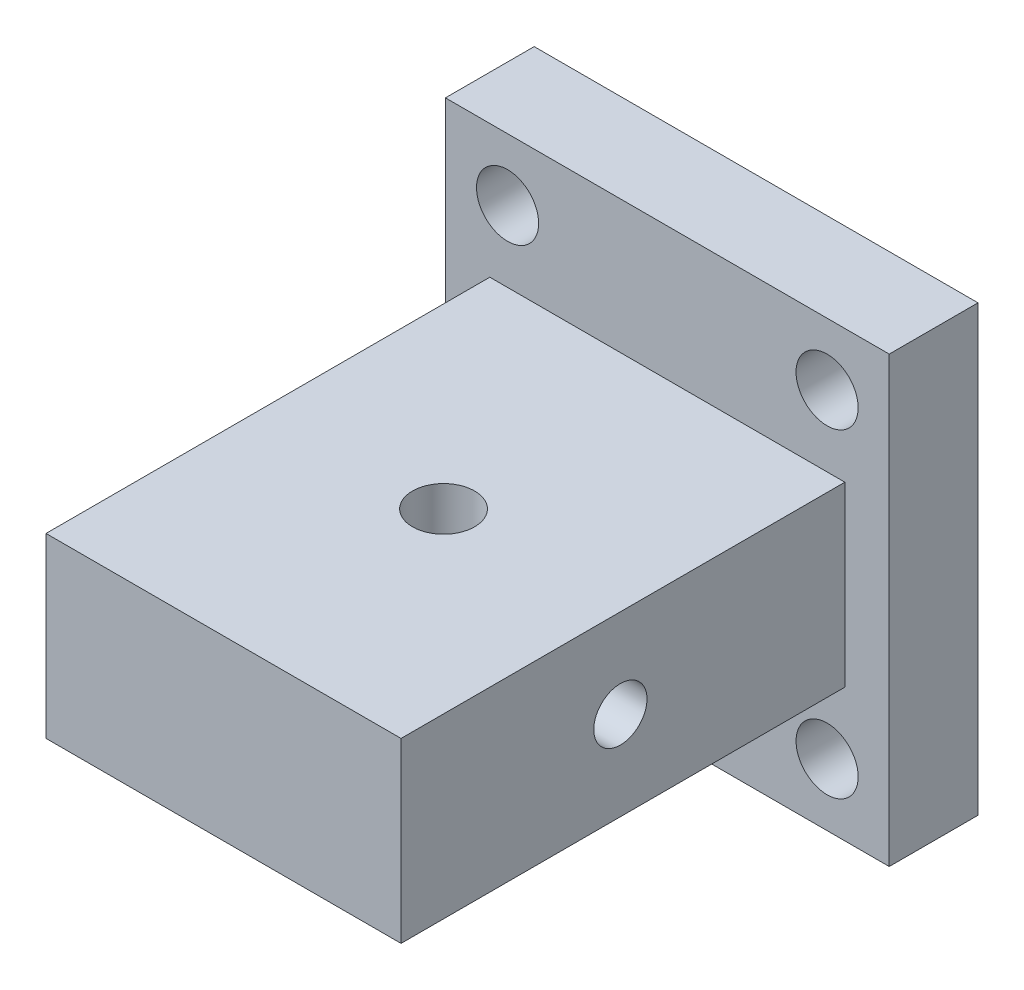
ISO-10303-21;
HEADER;
FILE_DESCRIPTION(('STEP AP214'),'2;1');
FILE_NAME('part.step','',(''),(''),'','','');
FILE_SCHEMA(('AUTOMOTIVE_DESIGN { 1 0 10303 214 1 1 1 1 }'));
ENDSEC;
DATA;
#1=APPLICATION_CONTEXT('core data for automotive mechanical design processes');
#2=APPLICATION_PROTOCOL_DEFINITION('international standard','automotive_design',2000,#1);
#3=PRODUCT_CONTEXT('',#1,'mechanical');
#4=PRODUCT('Part','Part','',(#3));
#5=PRODUCT_RELATED_PRODUCT_CATEGORY('part','',(#4));
#6=PRODUCT_DEFINITION_FORMATION('','',#4);
#7=PRODUCT_DEFINITION_CONTEXT('part definition',#1,'design');
#8=PRODUCT_DEFINITION('design','',#6,#7);
#9=PRODUCT_DEFINITION_SHAPE('','',#8);
#10=(LENGTH_UNIT() NAMED_UNIT(*) SI_UNIT(.MILLI.,.METRE.));
#11=(NAMED_UNIT(*) PLANE_ANGLE_UNIT() SI_UNIT($,.RADIAN.));
#12=(NAMED_UNIT(*) SI_UNIT($,.STERADIAN.) SOLID_ANGLE_UNIT());
#13=UNCERTAINTY_MEASURE_WITH_UNIT(LENGTH_MEASURE(1.E-05),#10,'distance_accuracy_value','');
#14=(GEOMETRIC_REPRESENTATION_CONTEXT(3) GLOBAL_UNCERTAINTY_ASSIGNED_CONTEXT((#13)) GLOBAL_UNIT_ASSIGNED_CONTEXT((#10,
#11,#12)) REPRESENTATION_CONTEXT('',''));
#15=CARTESIAN_POINT('',(0.,0.,0.));
#16=DIRECTION('',(0.,0.,1.));
#17=DIRECTION('',(1.,0.,0.));
#18=AXIS2_PLACEMENT_3D('',#15,#16,#17);
#19=CARTESIAN_POINT('',(-25.,0.,35.2899848463976));
#20=DIRECTION('',(1.,0.,0.));
#21=DIRECTION('',(0.,0.,-1.));
#22=AXIS2_PLACEMENT_3D('',#19,#20,#21);
#23=CYLINDRICAL_SURFACE('',#22,3.);
#24=CARTESIAN_POINT('',(20.,0.,35.2899848463976));
#25=DIRECTION('',(1.,0.,0.));
#26=DIRECTION('',(0.,0.,-1.));
#27=AXIS2_PLACEMENT_3D('',#24,#25,#26);
#28=CIRCLE('',#27,3.);
#29=CARTESIAN_POINT('',(20.,0.,32.2899848463976));
#30=VERTEX_POINT('',#29);
#31=EDGE_CURVE('E171',#30,#30,#28,.T.);
#32=ORIENTED_EDGE('',*,*,#31,.T.);
#33=EDGE_LOOP('',(#32));
#34=FACE_BOUND('',#33,.T.);
#35=CARTESIAN_POINT('',(-20.,0.,35.2899848463976));
#36=DIRECTION('',(-1.,0.,0.));
#37=DIRECTION('',(0.,0.,1.));
#38=AXIS2_PLACEMENT_3D('',#35,#36,#37);
#39=CIRCLE('',#38,3.);
#40=CARTESIAN_POINT('',(-20.,0.,38.2899848463976));
#41=VERTEX_POINT('',#40);
#42=EDGE_CURVE('E174',#41,#41,#39,.T.);
#43=ORIENTED_EDGE('',*,*,#42,.T.);
#44=EDGE_LOOP('',(#43));
#45=FACE_BOUND('',#44,.T.);
#46=DIRECTION('',(1.,0.,0.));
#47=VECTOR('',#46,1.);
#48=CARTESIAN_POINT('',(-25.,0.,38.2899848463976));
#49=LINE('',#48,#47);
#50=CARTESIAN_POINT('',(1.66542404359977,0.,38.2899848463976));
#51=VERTEX_POINT('',#50);
#52=CARTESIAN_POINT('',(-1.66542404359977,0.,38.2899848463976));
#53=VERTEX_POINT('',#52);
#54=EDGE_CURVE('E11',#51,#53,#49,.F.);
#55=ORIENTED_EDGE('',*,*,#54,.F.);
#56=CARTESIAN_POINT('',(1.66542404359977,0.,38.2899848463976));
#57=CARTESIAN_POINT('',(1.66538230950996,0.0481518719208806,38.2899966460254));
#58=CARTESIAN_POINT('',(1.667565897211,0.0962759116581786,38.2888261094072));
#59=CARTESIAN_POINT('',(1.67605317767951,0.191940055302888,38.284217223856));
#60=CARTESIAN_POINT('',(1.68234717425708,0.239481265857675,38.2807842117833));
#61=CARTESIAN_POINT('',(1.69858929746254,0.332886563251243,38.2718227108308));
#62=CARTESIAN_POINT('',(1.70847393905396,0.378765413997259,38.2663305774704));
#63=CARTESIAN_POINT('',(1.73142658030867,0.469454230189679,38.2533801397009));
#64=CARTESIAN_POINT('',(1.74449668033902,0.514263468884244,38.2459205377517));
#65=CARTESIAN_POINT('',(1.77986062033508,0.622767440648714,38.2253631286242));
#66=CARTESIAN_POINT('',(1.80364597246327,0.685782936125968,38.2112440262263));
#67=CARTESIAN_POINT('',(1.85540370100787,0.809135195903117,38.1795104484976));
#68=CARTESIAN_POINT('',(1.88337810590602,0.869470643978167,38.1618942784143));
#69=CARTESIAN_POINT('',(1.97226935102203,1.04776025079831,38.1038699192224));
#70=CARTESIAN_POINT('',(2.03773475738796,1.16185327276221,38.0585134924075));
#71=CARTESIAN_POINT('',(2.16101485338395,1.36025296108844,37.9656744045183));
#72=CARTESIAN_POINT('',(2.21793776647455,1.44611429965335,37.920212958185));
#73=CARTESIAN_POINT('',(2.33313492425084,1.61247684254439,37.8216381962503));
#74=CARTESIAN_POINT('',(2.39140991209111,1.69297500021367,37.7685205847081));
#75=CARTESIAN_POINT('',(2.50744404202027,1.84844337372949,37.6548318098248));
#76=CARTESIAN_POINT('',(2.56520418026771,1.92342867207951,37.5942822925791));
#77=CARTESIAN_POINT('',(2.67903086338832,2.06792644757097,37.4655405574596));
#78=CARTESIAN_POINT('',(2.73509726501376,2.13743846260385,37.3973476954347));
#79=CARTESIAN_POINT('',(2.87474476445089,2.30765019856549,37.2130289513801));
#80=CARTESIAN_POINT('',(2.95626570374454,2.40416695456465,37.0913541655803));
#81=CARTESIAN_POINT('',(3.10733290733121,2.57971415498602,36.8294132316946));
#82=CARTESIAN_POINT('',(3.17689634898637,2.65876973035129,36.6891742734737));
#83=CARTESIAN_POINT('',(3.28726711617649,2.78208898436559,36.4202314835731));
#84=CARTESIAN_POINT('',(3.33103131189795,2.83011858180776,36.2944843894987));
#85=CARTESIAN_POINT('',(3.40471361916409,2.90947475013154,36.0339327390208));
#86=CARTESIAN_POINT('',(3.43464060681718,2.94081203054621,35.8991340526526));
#87=CARTESIAN_POINT('',(3.47854461303296,2.98473329880833,35.6231269645348));
#88=CARTESIAN_POINT('',(3.49243269252006,2.99721283314379,35.4818872935568));
#89=CARTESIAN_POINT('',(3.50284457304123,3.00194791351435,35.198433504012));
#90=CARTESIAN_POINT('',(3.4993724000847,2.99420814879805,35.0562196190138));
#91=CARTESIAN_POINT('',(3.47668139204112,2.96056881801837,34.7883695248012));
#92=CARTESIAN_POINT('',(3.45890056611499,2.93635759041427,34.6623892546482));
#93=CARTESIAN_POINT('',(3.41085700162234,2.87291710966392,34.4168048177358));
#94=CARTESIAN_POINT('',(3.38059233328534,2.83368553471794,34.297201639986));
#95=CARTESIAN_POINT('',(3.30740406481644,2.73918614769174,34.0594460446968));
#96=CARTESIAN_POINT('',(3.26381621987621,2.68308025349457,33.9418355600057));
#97=CARTESIAN_POINT('',(3.16750185155569,2.55818982741359,33.7176738986884));
#98=CARTESIAN_POINT('',(3.11476925230147,2.48939686416252,33.6111301506567));
#99=CARTESIAN_POINT('',(2.97570478576573,2.3051939637301,33.3611340898363));
#100=CARTESIAN_POINT('',(2.88541765065629,2.18328379627394,33.2246006899643));
#101=CARTESIAN_POINT('',(2.74539469894006,1.98562624040168,33.0393217937127));
#102=CARTESIAN_POINT('',(2.69787139104926,1.91714761353444,32.9807338812986));
#103=CARTESIAN_POINT('',(2.60240642866809,1.77541403397418,32.8700721977547));
#104=CARTESIAN_POINT('',(2.55446488965672,1.70216036569981,32.8179966857907));
#105=CARTESIAN_POINT('',(2.4281599967005,1.50131267072919,32.6883866951345));
#106=CARTESIAN_POINT('',(2.3504261063222,1.3695374707125,32.6165019582311));
#107=CARTESIAN_POINT('',(2.24138879752333,1.16175920190249,32.5230286103159));
#108=CARTESIAN_POINT('',(2.20632893318025,1.09087529987084,32.4942805928466));
#109=CARTESIAN_POINT('',(2.14011710499217,0.945524049091378,32.4418360107417));
#110=CARTESIAN_POINT('',(2.10896259880565,0.871059075730598,32.4181361527134));
#111=CARTESIAN_POINT('',(2.04450195219273,0.697614399861296,32.3704837771058));
#112=CARTESIAN_POINT('',(2.01293073712073,0.597492418844655,32.348228957977));
#113=CARTESIAN_POINT('',(1.96330768844571,0.392423197109522,32.3139651513263));
#114=CARTESIAN_POINT('',(1.9452011975708,0.287497320222862,32.3019147132559));
#115=CARTESIAN_POINT('',(1.93274955839962,0.151449612738061,32.2936560679154));
#116=CARTESIAN_POINT('',(1.93067247885579,0.12123207185803,32.292281762612));
#117=CARTESIAN_POINT('',(1.92789504801224,0.0606801123599862,32.2904462349958));
#118=CARTESIAN_POINT('',(1.92719588431812,0.0303456154781308,32.2899858003323));
#119=CARTESIAN_POINT('',(1.92719459200974,0.,32.2899848463976));
#120=B_SPLINE_CURVE_WITH_KNOTS('',3,(#56,#57,#58,#59,#60,#61,#62,#63,#64,#65,#66,#67,#68,#69,
#70,#71,#72,#73,#74,#75,#76,#77,#78,#79,#80,#81,#82,#83,#84,#85,#86,#87,#88,#89,#90,#91,#92,#93,
#94,#95,#96,#97,#98,#99,#100,#101,#102,#103,#104,#105,#106,#107,#108,#109,#110,#111,#112,#113,
#114,#115,#116,#117,#118,#119),.UNSPECIFIED.,.F.,.F.,(4,2,2,2,2,2,2,2,2,2,2,2,2,2,2,2,2,2,2,2,2,
2,2,2,2,2,2,2,2,2,2,4),(0.,0.144347447202948,0.288355612058805,0.429932548698755,
0.571603089405522,0.77770462309082,0.983906282817794,1.39998933307164,1.73745040323068,
2.0751015682305,2.41179164525963,2.74851011857137,3.27269690636166,3.79612427166038,
4.2190323977182,4.64166886463407,5.06663785284589,5.49150829123659,5.87833024487237,
6.26521201642932,6.67589520182097,7.08685230236657,7.69561669429121,8.0010254871317,
8.30635246563763,8.81155194569927,9.06374390971539,9.31577083764874,9.6366080251224,
9.95613562247334,10.047060874841,10.1380644601468),.UNSPECIFIED.);
#121=CARTESIAN_POINT('',(1.92719459200974,0.,32.2899848463976));
#122=VERTEX_POINT('',#121);
#123=EDGE_CURVE('E120',#51,#122,#120,.T.);
#124=ORIENTED_EDGE('',*,*,#123,.T.);
#125=DIRECTION('',(1.,0.,0.));
#126=VECTOR('',#125,1.);
#127=CARTESIAN_POINT('',(-25.,0.,32.2899848463976));
#128=LINE('',#127,#126);
#129=CARTESIAN_POINT('',(-1.92719459200974,0.,32.2899848463976));
#130=VERTEX_POINT('',#129);
#131=EDGE_CURVE('E129',#130,#122,#128,.T.);
#132=ORIENTED_EDGE('',*,*,#131,.F.);
#133=CARTESIAN_POINT('',(-1.92719459200974,0.,32.2899848463976));
#134=CARTESIAN_POINT('',(-1.92715517539664,0.053561832512264,32.2899722235002));
#135=CARTESIAN_POINT('',(-1.92936817407956,0.107097861992282,32.2914187165505));
#136=CARTESIAN_POINT('',(-1.93799013699667,0.213577605295185,32.2971264931584));
#137=CARTESIAN_POINT('',(-1.94439084459079,0.266522276578228,32.3013822380397));
#138=CARTESIAN_POINT('',(-1.96095839981702,0.370717893062963,32.3125229746265));
#139=CARTESIAN_POINT('',(-1.97106826358582,0.421982303302066,32.3193682306711));
#140=CARTESIAN_POINT('',(-1.99459538122575,0.523355936135997,32.3355414948423));
#141=CARTESIAN_POINT('',(-2.00801450214145,0.573464489097307,32.3448709047375));
#142=CARTESIAN_POINT('',(-2.06438188553305,0.761565077249058,32.3847993492332));
#143=CARTESIAN_POINT('',(-2.1169416592839,0.895085555401932,32.4234151025515));
#144=CARTESIAN_POINT('',(-2.20473297831844,1.08713957460633,32.4930509635692));
#145=CARTESIAN_POINT('',(-2.23565277879568,1.15005805756768,32.5183595946823));
#146=CARTESIAN_POINT('',(-2.29956071572975,1.27317696806257,32.5727184049698));
#147=CARTESIAN_POINT('',(-2.33254812703549,1.33337833593991,32.6017672760964));
#148=CARTESIAN_POINT('',(-2.4143804519941,1.47668832826395,32.6768475597552));
#149=CARTESIAN_POINT('',(-2.46390022162958,1.55841337614691,32.7247817798824));
#150=CARTESIAN_POINT('',(-2.56377745865951,1.7166661701075,32.8278771042196));
#151=CARTESIAN_POINT('',(-2.61413526597172,1.79319173993039,32.8830412065647));
#152=CARTESIAN_POINT('',(-2.71411441903827,1.94077921027115,33.0003913557426));
#153=CARTESIAN_POINT('',(-2.76373732715881,2.01185467106518,33.0625589571116));
#154=CARTESIAN_POINT('',(-2.86112307552861,2.14847273944694,33.1940236562761));
#155=CARTESIAN_POINT('',(-2.90888571809726,2.21401475988461,33.2633215089317));
#156=CARTESIAN_POINT('',(-3.02705879648452,2.37382766337683,33.4495379214176));
#157=CARTESIAN_POINT('',(-3.09533797583248,2.4638708744901,33.5715514077721));
#158=CARTESIAN_POINT('',(-3.21992884216967,2.62646031313351,33.832173869828));
#159=CARTESIAN_POINT('',(-3.27625688427784,2.69903047110788,33.9707597544999));
#160=CARTESIAN_POINT('',(-3.3641363568881,2.81240924683298,34.2375508351169));
#161=CARTESIAN_POINT('',(-3.39827665682808,2.85652600239636,34.3634843867557));
#162=CARTESIAN_POINT('',(-3.4526747357941,2.9279835563262,34.6229203686279));
#163=CARTESIAN_POINT('',(-3.47294093669544,2.95533453082424,34.7564181538205));
#164=CARTESIAN_POINT('',(-3.49784328304387,2.99168057614218,35.0279313204356));
#165=CARTESIAN_POINT('',(-3.5024152760515,3.00060024729167,35.1659629210406));
#166=CARTESIAN_POINT('',(-3.49515988625525,2.9993367643761,35.4414996152089));
#167=CARTESIAN_POINT('',(-3.48333308370394,2.98915428621418,35.5790047272289));
#168=CARTESIAN_POINT('',(-3.44544668057202,2.95186073750057,35.8402598123842));
#169=CARTESIAN_POINT('',(-3.4203651443318,2.92589647705826,35.9643221311953));
#170=CARTESIAN_POINT('',(-3.35826430016147,2.85966627350084,36.2053845439328));
#171=CARTESIAN_POINT('',(-3.32124125208344,2.81939584921438,36.3223824115858));
#172=CARTESIAN_POINT('',(-3.22324891430665,2.71093698606339,36.5850458581257));
#173=CARTESIAN_POINT('',(-3.1584111890023,2.63791707346559,36.7272693960695));
#174=CARTESIAN_POINT('',(-3.01592933202074,2.47401077937042,36.9940684745323));
#175=CARTESIAN_POINT('',(-2.93825748134566,2.38308564302593,37.1186047072564));
#176=CARTESIAN_POINT('',(-2.80406944417954,2.221821307006,37.3081505753989));
#177=CARTESIAN_POINT('',(-2.74989537663288,2.15571541816421,37.3785430500309));
#178=CARTESIAN_POINT('',(-2.63937896692796,2.01802217497171,37.5118691380028));
#179=CARTESIAN_POINT('',(-2.58303677450375,1.9464351988166,37.5748032652075));
#180=CARTESIAN_POINT('',(-2.46939322743692,1.7980621102295,37.6933153063779));
#181=CARTESIAN_POINT('',(-2.41209143439699,1.7212735698071,37.7488897487179));
#182=CARTESIAN_POINT('',(-2.29799894794882,1.56257907477004,37.8526645367789));
#183=CARTESIAN_POINT('',(-2.24120802350332,1.48067558182431,37.9008683917993));
#184=CARTESIAN_POINT('',(-2.11742880603055,1.29249030825771,37.999817537119));
#185=CARTESIAN_POINT('',(-2.0510026332368,1.18485478899947,38.0487174461018));
#186=CARTESIAN_POINT('',(-1.92653308110833,0.960352604249297,38.1346516914491));
#187=CARTESIAN_POINT('',(-1.86847465622193,0.843503106492934,38.1717074739536));
#188=CARTESIAN_POINT('',(-1.78392616569093,0.635885778495532,38.2231421469341));
#189=CARTESIAN_POINT('',(-1.75318677656486,0.547753910836984,38.2409884584227));
#190=CARTESIAN_POINT('',(-1.70417355117862,0.367015836477656,38.2688376383969));
#191=CARTESIAN_POINT('',(-1.68584764184542,0.27443008775527,38.278873298393));
#192=CARTESIAN_POINT('',(-1.6721416819771,0.15083890804317,38.2863424666043));
#193=CARTESIAN_POINT('',(-1.66963238032959,0.120771565066703,38.2877049317063));
#194=CARTESIAN_POINT('',(-1.6662718760602,0.0604737781025257,38.2895266462149));
#195=CARTESIAN_POINT('',(-1.66542307375234,0.0302431612554292,38.2899845881085));
#196=CARTESIAN_POINT('',(-1.66542404359977,0.,38.2899848463976));
#197=B_SPLINE_CURVE_WITH_KNOTS('',3,(#133,#134,#135,#136,#137,#138,#139,#140,#141,#142,#143,
#144,#145,#146,#147,#148,#149,#150,#151,#152,#153,#154,#155,#156,#157,#158,#159,#160,#161,#162,
#163,#164,#165,#166,#167,#168,#169,#170,#171,#172,#173,#174,#175,#176,#177,#178,#179,#180,#181,
#182,#183,#184,#185,#186,#187,#188,#189,#190,#191,#192,#193,#194,#195,#196),.UNSPECIFIED.,.F.,
.F.,(4,2,2,2,2,2,2,2,2,2,2,2,2,2,2,2,2,2,2,2,2,2,2,2,2,2,2,2,2,2,2,4),(0.,0.160578646504422,
0.320841640522877,0.478739104385964,0.636725856798126,1.07961742636434,1.30314043074974,
1.52658547525645,1.84689925470347,2.16734628676122,2.48696824735217,2.80662408032543,
3.30356982327318,3.7998310463094,4.21130736200299,4.62253368075735,5.03543896022429,
5.44832962988454,5.83430480883353,6.2204009949367,6.73518167660666,7.25108906760831,
7.58288535076554,7.91465876054039,8.24658811738862,8.57835893989554,8.9843764999483,
9.3896546642841,9.67386653691471,9.95687866616839,10.0474379117522,10.1381279676714),.UNSPECIFIED.);
#198=EDGE_CURVE('E52',#130,#53,#197,.T.);
#199=ORIENTED_EDGE('',*,*,#198,.T.);
#200=EDGE_LOOP('',(#55,#124,#132,#199));
#201=FACE_BOUND('',#200,.T.);
#202=ADVANCED_FACE('F43',(#34,#45,#201),#23,.F.);
#203=CARTESIAN_POINT('',(25.,-25.,10.));
#204=DIRECTION('',(-1.,0.,0.));
#205=DIRECTION('',(0.,0.,1.));
#206=AXIS2_PLACEMENT_3D('',#203,#204,#205);
#207=PLANE('',#206);
#208=DIRECTION('',(0.,1.,0.));
#209=VECTOR('',#208,1.);
#210=CARTESIAN_POINT('',(25.,-25.,0.));
#211=LINE('',#210,#209);
#212=CARTESIAN_POINT('',(25.,-25.,0.));
#213=VERTEX_POINT('',#212);
#214=CARTESIAN_POINT('',(25.,25.,0.));
#215=VERTEX_POINT('',#214);
#216=EDGE_CURVE('E245',#213,#215,#211,.T.);
#217=ORIENTED_EDGE('',*,*,#216,.T.);
#218=DIRECTION('',(0.,0.,-1.));
#219=VECTOR('',#218,1.);
#220=CARTESIAN_POINT('',(25.,25.,10.));
#221=LINE('',#220,#219);
#222=CARTESIAN_POINT('',(25.,25.,10.));
#223=VERTEX_POINT('',#222);
#224=EDGE_CURVE('E292',#223,#215,#221,.T.);
#225=ORIENTED_EDGE('',*,*,#224,.F.);
#226=DIRECTION('',(0.,1.,0.));
#227=VECTOR('',#226,1.);
#228=CARTESIAN_POINT('',(25.,-25.,10.));
#229=LINE('',#228,#227);
#230=CARTESIAN_POINT('',(25.,-25.,10.));
#231=VERTEX_POINT('',#230);
#232=EDGE_CURVE('E255',#231,#223,#229,.T.);
#233=ORIENTED_EDGE('',*,*,#232,.F.);
#234=DIRECTION('',(0.,0.,-1.));
#235=VECTOR('',#234,1.);
#236=CARTESIAN_POINT('',(25.,-25.,10.));
#237=LINE('',#236,#235);
#238=EDGE_CURVE('E269',#231,#213,#237,.T.);
#239=ORIENTED_EDGE('',*,*,#238,.T.);
#240=EDGE_LOOP('',(#217,#225,#233,#239));
#241=FACE_BOUND('',#240,.T.);
#242=ADVANCED_FACE('F45',(#241),#207,.F.);
#243=CARTESIAN_POINT('',(-25.,25.,10.));
#244=DIRECTION('',(0.,-1.,0.));
#245=DIRECTION('',(0.,0.,-1.));
#246=AXIS2_PLACEMENT_3D('',#243,#244,#245);
#247=PLANE('',#246);
#248=DIRECTION('',(-1.,0.,0.));
#249=VECTOR('',#248,1.);
#250=CARTESIAN_POINT('',(-25.,25.,0.));
#251=LINE('',#250,#249);
#252=CARTESIAN_POINT('',(-25.,25.,0.));
#253=VERTEX_POINT('',#252);
#254=EDGE_CURVE('E273',#215,#253,#251,.T.);
#255=ORIENTED_EDGE('',*,*,#254,.T.);
#256=DIRECTION('',(0.,0.,-1.));
#257=VECTOR('',#256,1.);
#258=CARTESIAN_POINT('',(-25.,25.,10.));
#259=LINE('',#258,#257);
#260=CARTESIAN_POINT('',(-25.,25.,10.));
#261=VERTEX_POINT('',#260);
#262=EDGE_CURVE('E288',#261,#253,#259,.T.);
#263=ORIENTED_EDGE('',*,*,#262,.F.);
#264=DIRECTION('',(-1.,0.,0.));
#265=VECTOR('',#264,1.);
#266=CARTESIAN_POINT('',(-25.,25.,10.));
#267=LINE('',#266,#265);
#268=EDGE_CURVE('E259',#223,#261,#267,.T.);
#269=ORIENTED_EDGE('',*,*,#268,.F.);
#270=ORIENTED_EDGE('',*,*,#224,.T.);
#271=EDGE_LOOP('',(#255,#263,#269,#270));
#272=FACE_BOUND('',#271,.T.);
#273=ADVANCED_FACE('F166',(#272),#247,.F.);
#274=CARTESIAN_POINT('',(-25.,-25.,10.));
#275=DIRECTION('',(1.,0.,0.));
#276=DIRECTION('',(0.,0.,-1.));
#277=AXIS2_PLACEMENT_3D('',#274,#275,#276);
#278=PLANE('',#277);
#279=DIRECTION('',(0.,-1.,0.));
#280=VECTOR('',#279,1.);
#281=CARTESIAN_POINT('',(-25.,-25.,0.));
#282=LINE('',#281,#280);
#283=CARTESIAN_POINT('',(-25.,-25.,0.));
#284=VERTEX_POINT('',#283);
#285=EDGE_CURVE('E276',#253,#284,#282,.T.);
#286=ORIENTED_EDGE('',*,*,#285,.T.);
#287=DIRECTION('',(0.,0.,-1.));
#288=VECTOR('',#287,1.);
#289=CARTESIAN_POINT('',(-25.,-25.,10.));
#290=LINE('',#289,#288);
#291=CARTESIAN_POINT('',(-25.,-25.,10.));
#292=VERTEX_POINT('',#291);
#293=EDGE_CURVE('E284',#292,#284,#290,.T.);
#294=ORIENTED_EDGE('',*,*,#293,.F.);
#295=DIRECTION('',(0.,-1.,0.));
#296=VECTOR('',#295,1.);
#297=CARTESIAN_POINT('',(-25.,-25.,10.));
#298=LINE('',#297,#296);
#299=EDGE_CURVE('E263',#261,#292,#298,.T.);
#300=ORIENTED_EDGE('',*,*,#299,.F.);
#301=ORIENTED_EDGE('',*,*,#262,.T.);
#302=EDGE_LOOP('',(#286,#294,#300,#301));
#303=FACE_BOUND('',#302,.T.);
#304=ADVANCED_FACE('F308',(#303),#278,.F.);
#305=CARTESIAN_POINT('',(-25.,-25.,10.));
#306=DIRECTION('',(0.,1.,0.));
#307=DIRECTION('',(0.,0.,1.));
#308=AXIS2_PLACEMENT_3D('',#305,#306,#307);
#309=PLANE('',#308);
#310=DIRECTION('',(1.,0.,0.));
#311=VECTOR('',#310,1.);
#312=CARTESIAN_POINT('',(-25.,-25.,0.));
#313=LINE('',#312,#311);
#314=EDGE_CURVE('E260',#284,#213,#313,.T.);
#315=ORIENTED_EDGE('',*,*,#314,.T.);
#316=ORIENTED_EDGE('',*,*,#238,.F.);
#317=DIRECTION('',(1.,0.,0.));
#318=VECTOR('',#317,1.);
#319=CARTESIAN_POINT('',(-25.,-25.,10.));
#320=LINE('',#319,#318);
#321=EDGE_CURVE('E266',#292,#231,#320,.T.);
#322=ORIENTED_EDGE('',*,*,#321,.F.);
#323=ORIENTED_EDGE('',*,*,#293,.T.);
#324=EDGE_LOOP('',(#315,#316,#322,#323));
#325=FACE_BOUND('',#324,.T.);
#326=ADVANCED_FACE('F312',(#325),#309,.F.);
#327=CARTESIAN_POINT('',(0.,0.,10.));
#328=DIRECTION('',(0.,0.,-1.));
#329=DIRECTION('',(-1.,0.,0.));
#330=AXIS2_PLACEMENT_3D('',#327,#328,#329);
#331=PLANE('',#330);
#332=CARTESIAN_POINT('',(-18.,-18.,10.));
#333=DIRECTION('',(0.,0.,1.));
#334=DIRECTION('',(-1.,0.,0.));
#335=AXIS2_PLACEMENT_3D('',#332,#333,#334);
#336=CIRCLE('',#335,3.5);
#337=CARTESIAN_POINT('',(-21.5,-18.,10.));
#338=VERTEX_POINT('',#337);
#339=EDGE_CURVE('E182',#338,#338,#336,.T.);
#340=ORIENTED_EDGE('',*,*,#339,.F.);
#341=EDGE_LOOP('',(#340));
#342=FACE_BOUND('',#341,.T.);
#343=CARTESIAN_POINT('',(18.,-18.,10.));
#344=DIRECTION('',(0.,0.,1.));
#345=DIRECTION('',(1.,0.,0.));
#346=AXIS2_PLACEMENT_3D('',#343,#344,#345);
#347=CIRCLE('',#346,3.5);
#348=CARTESIAN_POINT('',(21.5,-18.,10.));
#349=VERTEX_POINT('',#348);
#350=EDGE_CURVE('E196',#349,#349,#347,.T.);
#351=ORIENTED_EDGE('',*,*,#350,.F.);
#352=EDGE_LOOP('',(#351));
#353=FACE_BOUND('',#352,.T.);
#354=CARTESIAN_POINT('',(18.,18.,10.));
#355=DIRECTION('',(0.,0.,1.));
#356=DIRECTION('',(-1.,0.,0.));
#357=AXIS2_PLACEMENT_3D('',#354,#355,#356);
#358=CIRCLE('',#357,3.5);
#359=CARTESIAN_POINT('',(14.5,18.,10.));
#360=VERTEX_POINT('',#359);
#361=EDGE_CURVE('E187',#360,#360,#358,.T.);
#362=ORIENTED_EDGE('',*,*,#361,.F.);
#363=EDGE_LOOP('',(#362));
#364=FACE_BOUND('',#363,.T.);
#365=CARTESIAN_POINT('',(-18.,18.,10.));
#366=DIRECTION('',(0.,0.,1.));
#367=DIRECTION('',(1.,0.,0.));
#368=AXIS2_PLACEMENT_3D('',#365,#366,#367);
#369=CIRCLE('',#368,3.5);
#370=CARTESIAN_POINT('',(-14.5,18.,10.));
#371=VERTEX_POINT('',#370);
#372=EDGE_CURVE('E191',#371,#371,#369,.T.);
#373=ORIENTED_EDGE('',*,*,#372,.F.);
#374=EDGE_LOOP('',(#373));
#375=FACE_BOUND('',#374,.T.);
#376=DIRECTION('',(0.,1.,0.));
#377=VECTOR('',#376,1.);
#378=CARTESIAN_POINT('',(-20.,-10.,10.));
#379=LINE('',#378,#377);
#380=CARTESIAN_POINT('',(-20.,-10.,10.));
#381=VERTEX_POINT('',#380);
#382=CARTESIAN_POINT('',(-20.,10.,10.));
#383=VERTEX_POINT('',#382);
#384=EDGE_CURVE('E219',#381,#383,#379,.T.);
#385=ORIENTED_EDGE('',*,*,#384,.T.);
#386=DIRECTION('',(1.,0.,0.));
#387=VECTOR('',#386,1.);
#388=CARTESIAN_POINT('',(-20.,10.,10.));
#389=LINE('',#388,#387);
#390=CARTESIAN_POINT('',(20.,10.,10.));
#391=VERTEX_POINT('',#390);
#392=EDGE_CURVE('E66',#383,#391,#389,.T.);
#393=ORIENTED_EDGE('',*,*,#392,.T.);
#394=DIRECTION('',(0.,1.,0.));
#395=VECTOR('',#394,1.);
#396=CARTESIAN_POINT('',(20.,-10.,10.));
#397=LINE('',#396,#395);
#398=CARTESIAN_POINT('',(20.,-10.,10.));
#399=VERTEX_POINT('',#398);
#400=EDGE_CURVE('E232',#399,#391,#397,.T.);
#401=ORIENTED_EDGE('',*,*,#400,.F.);
#402=DIRECTION('',(1.,0.,0.));
#403=VECTOR('',#402,1.);
#404=CARTESIAN_POINT('',(-20.,-10.,10.));
#405=LINE('',#404,#403);
#406=EDGE_CURVE('E236',#381,#399,#405,.T.);
#407=ORIENTED_EDGE('',*,*,#406,.F.);
#408=EDGE_LOOP('',(#385,#393,#401,#407));
#409=FACE_BOUND('',#408,.T.);
#410=ORIENTED_EDGE('',*,*,#232,.T.);
#411=ORIENTED_EDGE('',*,*,#268,.T.);
#412=ORIENTED_EDGE('',*,*,#299,.T.);
#413=ORIENTED_EDGE('',*,*,#321,.T.);
#414=EDGE_LOOP('',(#410,#411,#412,#413));
#415=FACE_BOUND('',#414,.T.);
#416=ADVANCED_FACE('F314',(#342,#353,#364,#375,#409,#415),#331,.F.);
#417=CARTESIAN_POINT('',(0.,0.,0.));
#418=DIRECTION('',(0.,0.,-1.));
#419=DIRECTION('',(-1.,0.,0.));
#420=AXIS2_PLACEMENT_3D('',#417,#418,#419);
#421=PLANE('',#420);
#422=CARTESIAN_POINT('',(-18.,-18.,0.));
#423=DIRECTION('',(0.,0.,1.));
#424=DIRECTION('',(-1.,0.,0.));
#425=AXIS2_PLACEMENT_3D('',#422,#423,#424);
#426=CIRCLE('',#425,3.5);
#427=CARTESIAN_POINT('',(-21.5,-18.,0.));
#428=VERTEX_POINT('',#427);
#429=EDGE_CURVE('E177',#428,#428,#426,.T.);
#430=ORIENTED_EDGE('',*,*,#429,.T.);
#431=EDGE_LOOP('',(#430));
#432=FACE_BOUND('',#431,.T.);
#433=CARTESIAN_POINT('',(18.,-18.,0.));
#434=DIRECTION('',(0.,0.,1.));
#435=DIRECTION('',(1.,0.,0.));
#436=AXIS2_PLACEMENT_3D('',#433,#434,#435);
#437=CIRCLE('',#436,3.5);
#438=CARTESIAN_POINT('',(21.5,-18.,0.));
#439=VERTEX_POINT('',#438);
#440=EDGE_CURVE('E200',#439,#439,#437,.T.);
#441=ORIENTED_EDGE('',*,*,#440,.T.);
#442=EDGE_LOOP('',(#441));
#443=FACE_BOUND('',#442,.T.);
#444=CARTESIAN_POINT('',(18.,18.,0.));
#445=DIRECTION('',(0.,0.,1.));
#446=DIRECTION('',(-1.,0.,0.));
#447=AXIS2_PLACEMENT_3D('',#444,#445,#446);
#448=CIRCLE('',#447,3.5);
#449=CARTESIAN_POINT('',(14.5,18.,0.));
#450=VERTEX_POINT('',#449);
#451=EDGE_CURVE('E192',#450,#450,#448,.T.);
#452=ORIENTED_EDGE('',*,*,#451,.T.);
#453=EDGE_LOOP('',(#452));
#454=FACE_BOUND('',#453,.T.);
#455=CARTESIAN_POINT('',(-18.,18.,0.));
#456=DIRECTION('',(0.,0.,1.));
#457=DIRECTION('',(1.,0.,0.));
#458=AXIS2_PLACEMENT_3D('',#455,#456,#457);
#459=CIRCLE('',#458,3.5);
#460=CARTESIAN_POINT('',(-14.5,18.,0.));
#461=VERTEX_POINT('',#460);
#462=EDGE_CURVE('E207',#461,#461,#459,.T.);
#463=ORIENTED_EDGE('',*,*,#462,.T.);
#464=EDGE_LOOP('',(#463));
#465=FACE_BOUND('',#464,.T.);
#466=ORIENTED_EDGE('',*,*,#216,.F.);
#467=ORIENTED_EDGE('',*,*,#314,.F.);
#468=ORIENTED_EDGE('',*,*,#285,.F.);
#469=ORIENTED_EDGE('',*,*,#254,.F.);
#470=EDGE_LOOP('',(#466,#467,#468,#469));
#471=FACE_BOUND('',#470,.T.);
#472=ADVANCED_FACE('F304',(#432,#443,#454,#465,#471),#421,.T.);
#473=CARTESIAN_POINT('',(-20.,10.,60.));
#474=DIRECTION('',(0.,1.,0.));
#475=DIRECTION('',(0.,0.,1.));
#476=AXIS2_PLACEMENT_3D('',#473,#474,#475);
#477=PLANE('',#476);
#478=CARTESIAN_POINT('',(0.,10.,35.211614700525));
#479=DIRECTION('',(0.,1.,0.));
#480=DIRECTION('',(0.,0.,1.));
#481=AXIS2_PLACEMENT_3D('',#478,#479,#480);
#482=CIRCLE('',#481,3.5);
#483=CARTESIAN_POINT('',(0.,10.,38.711614700525));
#484=VERTEX_POINT('',#483);
#485=EDGE_CURVE('E134',#484,#484,#482,.T.);
#486=ORIENTED_EDGE('',*,*,#485,.F.);
#487=EDGE_LOOP('',(#486));
#488=FACE_BOUND('',#487,.T.);
#489=ORIENTED_EDGE('',*,*,#392,.F.);
#490=DIRECTION('',(0.,0.,-1.));
#491=VECTOR('',#490,1.);
#492=CARTESIAN_POINT('',(-20.,10.,60.));
#493=LINE('',#492,#491);
#494=CARTESIAN_POINT('',(-20.,10.,60.));
#495=VERTEX_POINT('',#494);
#496=EDGE_CURVE('E242',#495,#383,#493,.T.);
#497=ORIENTED_EDGE('',*,*,#496,.F.);
#498=DIRECTION('',(1.,0.,0.));
#499=VECTOR('',#498,1.);
#500=CARTESIAN_POINT('',(-20.,10.,60.));
#501=LINE('',#500,#499);
#502=CARTESIAN_POINT('',(20.,10.,60.));
#503=VERTEX_POINT('',#502);
#504=EDGE_CURVE('E214',#495,#503,#501,.T.);
#505=ORIENTED_EDGE('',*,*,#504,.T.);
#506=DIRECTION('',(0.,0.,-1.));
#507=VECTOR('',#506,1.);
#508=CARTESIAN_POINT('',(20.,10.,60.));
#509=LINE('',#508,#507);
#510=EDGE_CURVE('E229',#503,#391,#509,.T.);
#511=ORIENTED_EDGE('',*,*,#510,.T.);
#512=EDGE_LOOP('',(#489,#497,#505,#511));
#513=FACE_BOUND('',#512,.T.);
#514=ADVANCED_FACE('F322',(#488,#513),#477,.T.);
#515=CARTESIAN_POINT('',(-20.,-10.,60.));
#516=DIRECTION('',(-1.,0.,0.));
#517=DIRECTION('',(0.,0.,1.));
#518=AXIS2_PLACEMENT_3D('',#515,#516,#517);
#519=PLANE('',#518);
#520=ORIENTED_EDGE('',*,*,#42,.F.);
#521=EDGE_LOOP('',(#520));
#522=FACE_BOUND('',#521,.T.);
#523=ORIENTED_EDGE('',*,*,#384,.F.);
#524=DIRECTION('',(0.,0.,-1.));
#525=VECTOR('',#524,1.);
#526=CARTESIAN_POINT('',(-20.,-10.,60.));
#527=LINE('',#526,#525);
#528=CARTESIAN_POINT('',(-20.,-10.,60.));
#529=VERTEX_POINT('',#528);
#530=EDGE_CURVE('E246',#529,#381,#527,.T.);
#531=ORIENTED_EDGE('',*,*,#530,.F.);
#532=DIRECTION('',(0.,1.,0.));
#533=VECTOR('',#532,1.);
#534=CARTESIAN_POINT('',(-20.,-10.,60.));
#535=LINE('',#534,#533);
#536=EDGE_CURVE('E225',#529,#495,#535,.T.);
#537=ORIENTED_EDGE('',*,*,#536,.T.);
#538=ORIENTED_EDGE('',*,*,#496,.T.);
#539=EDGE_LOOP('',(#523,#531,#537,#538));
#540=FACE_BOUND('',#539,.T.);
#541=ADVANCED_FACE('F358',(#522,#540),#519,.T.);
#542=CARTESIAN_POINT('',(-20.,-10.,60.));
#543=DIRECTION('',(0.,1.,0.));
#544=DIRECTION('',(0.,0.,1.));
#545=AXIS2_PLACEMENT_3D('',#542,#543,#544);
#546=PLANE('',#545);
#547=ORIENTED_EDGE('',*,*,#406,.T.);
#548=DIRECTION('',(0.,0.,-1.));
#549=VECTOR('',#548,1.);
#550=CARTESIAN_POINT('',(20.,-10.,60.));
#551=LINE('',#550,#549);
#552=CARTESIAN_POINT('',(20.,-10.,60.));
#553=VERTEX_POINT('',#552);
#554=EDGE_CURVE('E249',#553,#399,#551,.T.);
#555=ORIENTED_EDGE('',*,*,#554,.F.);
#556=DIRECTION('',(1.,0.,0.));
#557=VECTOR('',#556,1.);
#558=CARTESIAN_POINT('',(-20.,-10.,60.));
#559=LINE('',#558,#557);
#560=EDGE_CURVE('E222',#529,#553,#559,.T.);
#561=ORIENTED_EDGE('',*,*,#560,.F.);
#562=ORIENTED_EDGE('',*,*,#530,.T.);
#563=EDGE_LOOP('',(#547,#555,#561,#562));
#564=FACE_BOUND('',#563,.T.);
#565=ADVANCED_FACE('F352',(#564),#546,.F.);
#566=CARTESIAN_POINT('',(20.,-10.,60.));
#567=DIRECTION('',(-1.,0.,0.));
#568=DIRECTION('',(0.,0.,1.));
#569=AXIS2_PLACEMENT_3D('',#566,#567,#568);
#570=PLANE('',#569);
#571=ORIENTED_EDGE('',*,*,#31,.F.);
#572=EDGE_LOOP('',(#571));
#573=FACE_BOUND('',#572,.T.);
#574=ORIENTED_EDGE('',*,*,#400,.T.);
#575=ORIENTED_EDGE('',*,*,#510,.F.);
#576=DIRECTION('',(0.,1.,0.));
#577=VECTOR('',#576,1.);
#578=CARTESIAN_POINT('',(20.,-10.,60.));
#579=LINE('',#578,#577);
#580=EDGE_CURVE('E218',#553,#503,#579,.T.);
#581=ORIENTED_EDGE('',*,*,#580,.F.);
#582=ORIENTED_EDGE('',*,*,#554,.T.);
#583=EDGE_LOOP('',(#574,#575,#581,#582));
#584=FACE_BOUND('',#583,.T.);
#585=ADVANCED_FACE('F357',(#573,#584),#570,.F.);
#586=CARTESIAN_POINT('',(0.,0.,60.));
#587=DIRECTION('',(0.,0.,1.));
#588=DIRECTION('',(1.,0.,0.));
#589=AXIS2_PLACEMENT_3D('',#586,#587,#588);
#590=PLANE('',#589);
#591=ORIENTED_EDGE('',*,*,#504,.F.);
#592=ORIENTED_EDGE('',*,*,#536,.F.);
#593=ORIENTED_EDGE('',*,*,#560,.T.);
#594=ORIENTED_EDGE('',*,*,#580,.T.);
#595=EDGE_LOOP('',(#591,#592,#593,#594));
#596=FACE_BOUND('',#595,.T.);
#597=ADVANCED_FACE('F369',(#596),#590,.T.);
#598=CARTESIAN_POINT('',(-18.,18.,0.));
#599=DIRECTION('',(0.,0.,1.));
#600=DIRECTION('',(1.,0.,0.));
#601=AXIS2_PLACEMENT_3D('',#598,#599,#600);
#602=CYLINDRICAL_SURFACE('',#601,3.5);
#603=ORIENTED_EDGE('',*,*,#462,.F.);
#604=EDGE_LOOP('',(#603));
#605=FACE_BOUND('',#604,.T.);
#606=ORIENTED_EDGE('',*,*,#372,.T.);
#607=EDGE_LOOP('',(#606));
#608=FACE_BOUND('',#607,.T.);
#609=ADVANCED_FACE('F373',(#605,#608),#602,.F.);
#610=CARTESIAN_POINT('',(18.,18.,0.));
#611=DIRECTION('',(0.,0.,1.));
#612=DIRECTION('',(1.,0.,0.));
#613=AXIS2_PLACEMENT_3D('',#610,#611,#612);
#614=CYLINDRICAL_SURFACE('',#613,3.5);
#615=ORIENTED_EDGE('',*,*,#451,.F.);
#616=EDGE_LOOP('',(#615));
#617=FACE_BOUND('',#616,.T.);
#618=ORIENTED_EDGE('',*,*,#361,.T.);
#619=EDGE_LOOP('',(#618));
#620=FACE_BOUND('',#619,.T.);
#621=ADVANCED_FACE('F398',(#617,#620),#614,.F.);
#622=CARTESIAN_POINT('',(18.,-18.,0.));
#623=DIRECTION('',(0.,0.,1.));
#624=DIRECTION('',(1.,0.,0.));
#625=AXIS2_PLACEMENT_3D('',#622,#623,#624);
#626=CYLINDRICAL_SURFACE('',#625,3.5);
#627=ORIENTED_EDGE('',*,*,#440,.F.);
#628=EDGE_LOOP('',(#627));
#629=FACE_BOUND('',#628,.T.);
#630=ORIENTED_EDGE('',*,*,#350,.T.);
#631=EDGE_LOOP('',(#630));
#632=FACE_BOUND('',#631,.T.);
#633=ADVANCED_FACE('F409',(#629,#632),#626,.F.);
#634=CARTESIAN_POINT('',(-18.,-18.,0.));
#635=DIRECTION('',(0.,0.,1.));
#636=DIRECTION('',(1.,0.,0.));
#637=AXIS2_PLACEMENT_3D('',#634,#635,#636);
#638=CYLINDRICAL_SURFACE('',#637,3.5);
#639=ORIENTED_EDGE('',*,*,#429,.F.);
#640=EDGE_LOOP('',(#639));
#641=FACE_BOUND('',#640,.T.);
#642=ORIENTED_EDGE('',*,*,#339,.T.);
#643=EDGE_LOOP('',(#642));
#644=FACE_BOUND('',#643,.T.);
#645=ADVANCED_FACE('F153',(#641,#644),#638,.F.);
#646=CARTESIAN_POINT('',(0.,0.,35.211614700525));
#647=DIRECTION('',(0.,1.,0.));
#648=DIRECTION('',(0.,0.,1.));
#649=AXIS2_PLACEMENT_3D('',#646,#647,#648);
#650=CYLINDRICAL_SURFACE('',#649,3.5);
#651=ORIENTED_EDGE('',*,*,#485,.T.);
#652=EDGE_LOOP('',(#651));
#653=FACE_BOUND('',#652,.T.);
#654=CARTESIAN_POINT('',(0.,0.,35.211614700525));
#655=DIRECTION('',(0.,1.,0.));
#656=DIRECTION('',(0.,0.,1.));
#657=AXIS2_PLACEMENT_3D('',#654,#655,#656);
#658=CIRCLE('',#657,3.5);
#659=EDGE_CURVE('E58',#122,#130,#658,.T.);
#660=ORIENTED_EDGE('',*,*,#659,.F.);
#661=ORIENTED_EDGE('',*,*,#123,.F.);
#662=EDGE_CURVE('E123',#53,#51,#658,.T.);
#663=ORIENTED_EDGE('',*,*,#662,.F.);
#664=ORIENTED_EDGE('',*,*,#198,.F.);
#665=EDGE_LOOP('',(#660,#661,#663,#664));
#666=FACE_BOUND('',#665,.T.);
#667=ADVANCED_FACE('F122',(#653,#666),#650,.F.);
#668=CARTESIAN_POINT('',(0.,0.,35.211614700525));
#669=DIRECTION('',(0.,1.,0.));
#670=DIRECTION('',(0.,0.,1.));
#671=AXIS2_PLACEMENT_3D('',#668,#669,#670);
#672=PLANE('',#671);
#673=ORIENTED_EDGE('',*,*,#54,.T.);
#674=ORIENTED_EDGE('',*,*,#662,.T.);
#675=EDGE_LOOP('',(#673,#674));
#676=FACE_BOUND('',#675,.T.);
#677=ADVANCED_FACE('F132',(#676),#672,.T.);
#678=ORIENTED_EDGE('',*,*,#131,.T.);
#679=ORIENTED_EDGE('',*,*,#659,.T.);
#680=EDGE_LOOP('',(#678,#679));
#681=FACE_BOUND('',#680,.T.);
#682=ADVANCED_FACE('F157',(#681),#672,.T.);
#683=CLOSED_SHELL('',(#202,#242,#273,#304,#326,#416,#472,#514,#541,#565,#585,#597,#609,#621,
#633,#645,#667,#677,#682));
#684=MANIFOLD_SOLID_BREP('B2',#683);
#685=ADVANCED_BREP_SHAPE_REPRESENTATION('',(#18,#684),#14);
#686=SHAPE_DEFINITION_REPRESENTATION(#9,#685);
ENDSEC;
END-ISO-10303-21;
